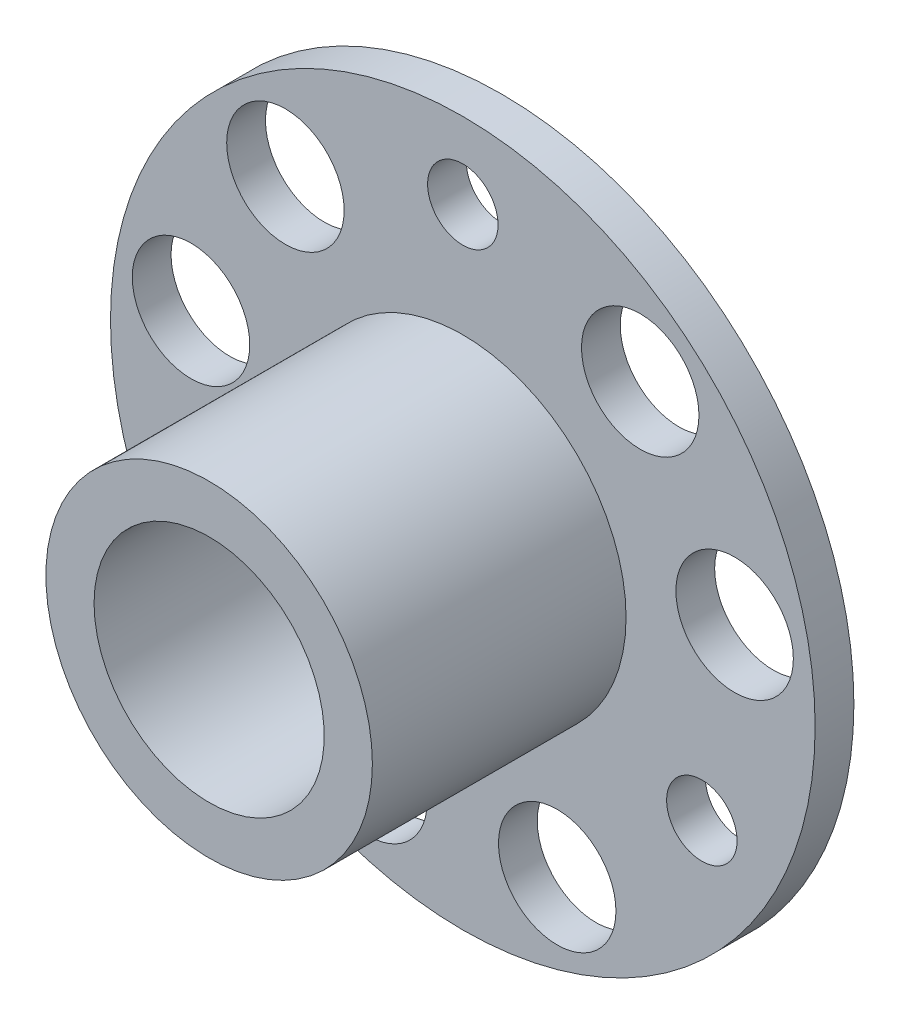
ISO-10303-21;
HEADER;
FILE_DESCRIPTION(('STEP AP214'),'2;1');
FILE_NAME('part.step','',(''),(''),'','','');
FILE_SCHEMA(('AUTOMOTIVE_DESIGN { 1 0 10303 214 1 1 1 1 }'));
ENDSEC;
DATA;
#1=APPLICATION_CONTEXT('core data for automotive mechanical design processes');
#2=APPLICATION_PROTOCOL_DEFINITION('international standard','automotive_design',2000,#1);
#3=PRODUCT_CONTEXT('',#1,'mechanical');
#4=PRODUCT('Part','Part','',(#3));
#5=PRODUCT_RELATED_PRODUCT_CATEGORY('part','',(#4));
#6=PRODUCT_DEFINITION_FORMATION('','',#4);
#7=PRODUCT_DEFINITION_CONTEXT('part definition',#1,'design');
#8=PRODUCT_DEFINITION('design','',#6,#7);
#9=PRODUCT_DEFINITION_SHAPE('','',#8);
#10=(LENGTH_UNIT() NAMED_UNIT(*) SI_UNIT(.MILLI.,.METRE.));
#11=(NAMED_UNIT(*) PLANE_ANGLE_UNIT() SI_UNIT($,.RADIAN.));
#12=(NAMED_UNIT(*) SI_UNIT($,.STERADIAN.) SOLID_ANGLE_UNIT());
#13=UNCERTAINTY_MEASURE_WITH_UNIT(LENGTH_MEASURE(1.E-05),#10,'distance_accuracy_value','');
#14=(GEOMETRIC_REPRESENTATION_CONTEXT(3) GLOBAL_UNCERTAINTY_ASSIGNED_CONTEXT((#13)) GLOBAL_UNIT_ASSIGNED_CONTEXT((#10,
#11,#12)) REPRESENTATION_CONTEXT('',''));
#15=CARTESIAN_POINT('',(0.,0.,0.));
#16=DIRECTION('',(0.,0.,1.));
#17=DIRECTION('',(1.,0.,0.));
#18=AXIS2_PLACEMENT_3D('',#15,#16,#17);
#19=CARTESIAN_POINT('',(0.,0.,1.65));
#20=DIRECTION('',(0.,0.,1.));
#21=DIRECTION('',(1.,0.,0.));
#22=AXIS2_PLACEMENT_3D('',#19,#20,#21);
#23=PLANE('',#22);
#24=CARTESIAN_POINT('',(0.,11.75,1.65));
#25=DIRECTION('',(0.,0.,1.));
#26=DIRECTION('',(1.,0.,0.));
#27=AXIS2_PLACEMENT_3D('',#24,#25,#26);
#28=CIRCLE('',#27,1.49999999999999);
#29=CARTESIAN_POINT('',(1.49999999999999,11.75,1.65));
#30=VERTEX_POINT('',#29);
#31=EDGE_CURVE('E104',#30,#30,#28,.T.);
#32=ORIENTED_EDGE('',*,*,#31,.F.);
#33=EDGE_LOOP('',(#32));
#34=FACE_BOUND('',#33,.T.);
#35=CARTESIAN_POINT('',(-10.1757984944672,-5.875,1.65));
#36=DIRECTION('',(0.,0.,1.));
#37=DIRECTION('',(1.,0.,0.));
#38=AXIS2_PLACEMENT_3D('',#35,#36,#37);
#39=CIRCLE('',#38,1.49999999999999);
#40=CARTESIAN_POINT('',(-8.67579849446717,-5.875,1.65));
#41=VERTEX_POINT('',#40);
#42=EDGE_CURVE('E98',#41,#41,#39,.T.);
#43=ORIENTED_EDGE('',*,*,#42,.F.);
#44=EDGE_LOOP('',(#43));
#45=FACE_BOUND('',#44,.T.);
#46=CARTESIAN_POINT('',(10.1757984944672,-5.87500000000001,1.65));
#47=DIRECTION('',(0.,0.,1.));
#48=DIRECTION('',(1.,0.,0.));
#49=AXIS2_PLACEMENT_3D('',#46,#47,#48);
#50=CIRCLE('',#49,1.49999999999999);
#51=CARTESIAN_POINT('',(11.6757984944671,-5.87500000000001,1.65));
#52=VERTEX_POINT('',#51);
#53=EDGE_CURVE('E92',#52,#52,#50,.T.);
#54=ORIENTED_EDGE('',*,*,#53,.F.);
#55=EDGE_LOOP('',(#54));
#56=FACE_BOUND('',#55,.T.);
#57=CARTESIAN_POINT('',(-7.55275441381684,9.00102220664799,1.65));
#58=DIRECTION('',(0.,0.,1.));
#59=DIRECTION('',(1.,0.,0.));
#60=AXIS2_PLACEMENT_3D('',#57,#58,#59);
#61=CIRCLE('',#60,2.49999999999999);
#62=CARTESIAN_POINT('',(-5.05275441381685,9.00102220664799,1.65));
#63=VERTEX_POINT('',#62);
#64=EDGE_CURVE('E86',#63,#63,#61,.T.);
#65=ORIENTED_EDGE('',*,*,#64,.F.);
#66=EDGE_LOOP('',(#65));
#67=FACE_BOUND('',#66,.T.);
#68=CARTESIAN_POINT('',(-11.5714910978934,2.04036608758643,1.65));
#69=DIRECTION('',(0.,0.,1.));
#70=DIRECTION('',(1.,0.,0.));
#71=AXIS2_PLACEMENT_3D('',#68,#69,#70);
#72=CIRCLE('',#71,2.49999999999999);
#73=CARTESIAN_POINT('',(-9.07149109789346,2.04036608758643,1.65));
#74=VERTEX_POINT('',#73);
#75=EDGE_CURVE('E80',#74,#74,#72,.T.);
#76=ORIENTED_EDGE('',*,*,#75,.F.);
#77=EDGE_LOOP('',(#76));
#78=FACE_BOUND('',#77,.T.);
#79=CARTESIAN_POINT('',(-4.01873668407661,-11.0413882942344,1.65));
#80=DIRECTION('',(0.,0.,1.));
#81=DIRECTION('',(1.,0.,0.));
#82=AXIS2_PLACEMENT_3D('',#79,#80,#81);
#83=CIRCLE('',#82,2.49999999999999);
#84=CARTESIAN_POINT('',(-1.51873668407662,-11.0413882942344,1.65));
#85=VERTEX_POINT('',#84);
#86=EDGE_CURVE('E74',#85,#85,#83,.T.);
#87=ORIENTED_EDGE('',*,*,#86,.F.);
#88=EDGE_LOOP('',(#87));
#89=FACE_BOUND('',#88,.T.);
#90=CARTESIAN_POINT('',(4.01873668407661,-11.0413882942344,1.65));
#91=DIRECTION('',(0.,0.,1.));
#92=DIRECTION('',(1.,0.,0.));
#93=AXIS2_PLACEMENT_3D('',#90,#91,#92);
#94=CIRCLE('',#93,2.49999999999999);
#95=CARTESIAN_POINT('',(6.51873668407659,-11.0413882942344,1.65));
#96=VERTEX_POINT('',#95);
#97=EDGE_CURVE('E68',#96,#96,#94,.T.);
#98=ORIENTED_EDGE('',*,*,#97,.F.);
#99=EDGE_LOOP('',(#98));
#100=FACE_BOUND('',#99,.T.);
#101=CARTESIAN_POINT('',(11.5714910978934,2.04036608758643,1.65));
#102=DIRECTION('',(0.,0.,1.));
#103=DIRECTION('',(1.,0.,0.));
#104=AXIS2_PLACEMENT_3D('',#101,#102,#103);
#105=CIRCLE('',#104,2.49999999999999);
#106=CARTESIAN_POINT('',(14.0714910978934,2.04036608758643,1.65));
#107=VERTEX_POINT('',#106);
#108=EDGE_CURVE('E62',#107,#107,#105,.T.);
#109=ORIENTED_EDGE('',*,*,#108,.F.);
#110=EDGE_LOOP('',(#109));
#111=FACE_BOUND('',#110,.T.);
#112=CARTESIAN_POINT('',(7.55275441381684,9.00102220664799,1.65));
#113=DIRECTION('',(0.,0.,1.));
#114=DIRECTION('',(1.,0.,0.));
#115=AXIS2_PLACEMENT_3D('',#112,#113,#114);
#116=CIRCLE('',#115,2.49999999999999);
#117=CARTESIAN_POINT('',(10.0527544138168,9.00102220664799,1.65));
#118=VERTEX_POINT('',#117);
#119=EDGE_CURVE('E54',#118,#118,#116,.T.);
#120=ORIENTED_EDGE('',*,*,#119,.F.);
#121=EDGE_LOOP('',(#120));
#122=FACE_BOUND('',#121,.T.);
#123=CARTESIAN_POINT('',(0.,0.,1.65));
#124=DIRECTION('',(0.,0.,1.));
#125=DIRECTION('',(1.,0.,0.));
#126=AXIS2_PLACEMENT_3D('',#123,#124,#125);
#127=CIRCLE('',#126,15.);
#128=CARTESIAN_POINT('',(15.,0.,1.65));
#129=VERTEX_POINT('',#128);
#130=EDGE_CURVE('E45',#129,#129,#127,.T.);
#131=ORIENTED_EDGE('',*,*,#130,.T.);
#132=EDGE_LOOP('',(#131));
#133=FACE_BOUND('',#132,.T.);
#134=CARTESIAN_POINT('',(0.,0.,1.65));
#135=DIRECTION('',(0.,0.,1.));
#136=DIRECTION('',(1.,0.,0.));
#137=AXIS2_PLACEMENT_3D('',#134,#135,#136);
#138=CIRCLE('',#137,6.95);
#139=CARTESIAN_POINT('',(6.95,0.,1.65));
#140=VERTEX_POINT('',#139);
#141=EDGE_CURVE('E51',#140,#140,#138,.T.);
#142=ORIENTED_EDGE('',*,*,#141,.F.);
#143=EDGE_LOOP('',(#142));
#144=FACE_BOUND('',#143,.T.);
#145=ADVANCED_FACE('F30',(#34,#45,#56,#67,#78,#89,#100,#111,#122,#133,#144),#23,.T.);
#146=CARTESIAN_POINT('',(0.,0.,0.));
#147=DIRECTION('',(0.,0.,1.));
#148=DIRECTION('',(1.,0.,0.));
#149=AXIS2_PLACEMENT_3D('',#146,#147,#148);
#150=CYLINDRICAL_SURFACE('',#149,15.);
#151=CARTESIAN_POINT('',(0.,0.,0.));
#152=DIRECTION('',(0.,0.,1.));
#153=DIRECTION('',(1.,0.,0.));
#154=AXIS2_PLACEMENT_3D('',#151,#152,#153);
#155=CIRCLE('',#154,15.);
#156=CARTESIAN_POINT('',(15.,0.,0.));
#157=VERTEX_POINT('',#156);
#158=EDGE_CURVE('E41',#157,#157,#155,.T.);
#159=ORIENTED_EDGE('',*,*,#158,.T.);
#160=EDGE_LOOP('',(#159));
#161=FACE_BOUND('',#160,.T.);
#162=ORIENTED_EDGE('',*,*,#130,.F.);
#163=EDGE_LOOP('',(#162));
#164=FACE_BOUND('',#163,.T.);
#165=ADVANCED_FACE('F130',(#161,#164),#150,.T.);
#166=CARTESIAN_POINT('',(15.,0.,0.));
#167=DIRECTION('',(0.,0.,-1.));
#168=DIRECTION('',(-1.,0.,0.));
#169=AXIS2_PLACEMENT_3D('',#166,#167,#168);
#170=PLANE('',#169);
#171=CARTESIAN_POINT('',(0.,0.,0.));
#172=DIRECTION('',(0.,0.,-1.));
#173=DIRECTION('',(-1.,0.,0.));
#174=AXIS2_PLACEMENT_3D('',#171,#172,#173);
#175=CIRCLE('',#174,5.39999999999999);
#176=CARTESIAN_POINT('',(-5.39999999999999,0.,0.));
#177=VERTEX_POINT('',#176);
#178=EDGE_CURVE('E10',#177,#177,#175,.F.);
#179=ORIENTED_EDGE('',*,*,#178,.T.);
#180=EDGE_LOOP('',(#179));
#181=FACE_BOUND('',#180,.T.);
#182=CARTESIAN_POINT('',(0.,11.75,0.));
#183=DIRECTION('',(0.,0.,-1.));
#184=DIRECTION('',(-1.,0.,0.));
#185=AXIS2_PLACEMENT_3D('',#182,#183,#184);
#186=CIRCLE('',#185,1.49999999999999);
#187=CARTESIAN_POINT('',(-1.49999999999999,11.75,0.));
#188=VERTEX_POINT('',#187);
#189=EDGE_CURVE('E107',#188,#188,#186,.T.);
#190=ORIENTED_EDGE('',*,*,#189,.F.);
#191=EDGE_LOOP('',(#190));
#192=FACE_BOUND('',#191,.T.);
#193=CARTESIAN_POINT('',(-10.1757984944672,-5.875,0.));
#194=DIRECTION('',(0.,0.,-1.));
#195=DIRECTION('',(-1.,0.,0.));
#196=AXIS2_PLACEMENT_3D('',#193,#194,#195);
#197=CIRCLE('',#196,1.49999999999999);
#198=CARTESIAN_POINT('',(-11.6757984944671,-5.875,0.));
#199=VERTEX_POINT('',#198);
#200=EDGE_CURVE('E101',#199,#199,#197,.T.);
#201=ORIENTED_EDGE('',*,*,#200,.F.);
#202=EDGE_LOOP('',(#201));
#203=FACE_BOUND('',#202,.T.);
#204=CARTESIAN_POINT('',(10.1757984944672,-5.87500000000001,0.));
#205=DIRECTION('',(0.,0.,-1.));
#206=DIRECTION('',(-1.,0.,0.));
#207=AXIS2_PLACEMENT_3D('',#204,#205,#206);
#208=CIRCLE('',#207,1.49999999999999);
#209=CARTESIAN_POINT('',(8.67579849446716,-5.87500000000001,0.));
#210=VERTEX_POINT('',#209);
#211=EDGE_CURVE('E95',#210,#210,#208,.T.);
#212=ORIENTED_EDGE('',*,*,#211,.F.);
#213=EDGE_LOOP('',(#212));
#214=FACE_BOUND('',#213,.T.);
#215=CARTESIAN_POINT('',(-7.55275441381684,9.00102220664799,0.));
#216=DIRECTION('',(0.,0.,-1.));
#217=DIRECTION('',(-1.,0.,0.));
#218=AXIS2_PLACEMENT_3D('',#215,#216,#217);
#219=CIRCLE('',#218,2.49999999999999);
#220=CARTESIAN_POINT('',(-10.0527544138168,9.00102220664799,0.));
#221=VERTEX_POINT('',#220);
#222=EDGE_CURVE('E89',#221,#221,#219,.T.);
#223=ORIENTED_EDGE('',*,*,#222,.F.);
#224=EDGE_LOOP('',(#223));
#225=FACE_BOUND('',#224,.T.);
#226=CARTESIAN_POINT('',(-11.5714910978934,2.04036608758643,0.));
#227=DIRECTION('',(0.,0.,-1.));
#228=DIRECTION('',(-1.,0.,0.));
#229=AXIS2_PLACEMENT_3D('',#226,#227,#228);
#230=CIRCLE('',#229,2.49999999999999);
#231=CARTESIAN_POINT('',(-14.0714910978934,2.04036608758643,0.));
#232=VERTEX_POINT('',#231);
#233=EDGE_CURVE('E83',#232,#232,#230,.T.);
#234=ORIENTED_EDGE('',*,*,#233,.F.);
#235=EDGE_LOOP('',(#234));
#236=FACE_BOUND('',#235,.T.);
#237=CARTESIAN_POINT('',(-4.01873668407661,-11.0413882942344,0.));
#238=DIRECTION('',(0.,0.,-1.));
#239=DIRECTION('',(-1.,0.,0.));
#240=AXIS2_PLACEMENT_3D('',#237,#238,#239);
#241=CIRCLE('',#240,2.49999999999999);
#242=CARTESIAN_POINT('',(-6.5187366840766,-11.0413882942344,0.));
#243=VERTEX_POINT('',#242);
#244=EDGE_CURVE('E77',#243,#243,#241,.T.);
#245=ORIENTED_EDGE('',*,*,#244,.F.);
#246=EDGE_LOOP('',(#245));
#247=FACE_BOUND('',#246,.T.);
#248=CARTESIAN_POINT('',(4.01873668407661,-11.0413882942344,0.));
#249=DIRECTION('',(0.,0.,-1.));
#250=DIRECTION('',(-1.,0.,0.));
#251=AXIS2_PLACEMENT_3D('',#248,#249,#250);
#252=CIRCLE('',#251,2.49999999999999);
#253=CARTESIAN_POINT('',(1.51873668407662,-11.0413882942344,0.));
#254=VERTEX_POINT('',#253);
#255=EDGE_CURVE('E71',#254,#254,#252,.T.);
#256=ORIENTED_EDGE('',*,*,#255,.F.);
#257=EDGE_LOOP('',(#256));
#258=FACE_BOUND('',#257,.T.);
#259=CARTESIAN_POINT('',(11.5714910978934,2.04036608758643,0.));
#260=DIRECTION('',(0.,0.,-1.));
#261=DIRECTION('',(-1.,0.,0.));
#262=AXIS2_PLACEMENT_3D('',#259,#260,#261);
#263=CIRCLE('',#262,2.49999999999999);
#264=CARTESIAN_POINT('',(9.07149109789346,2.04036608758643,0.));
#265=VERTEX_POINT('',#264);
#266=EDGE_CURVE('E65',#265,#265,#263,.T.);
#267=ORIENTED_EDGE('',*,*,#266,.F.);
#268=EDGE_LOOP('',(#267));
#269=FACE_BOUND('',#268,.T.);
#270=CARTESIAN_POINT('',(7.55275441381684,9.00102220664799,0.));
#271=DIRECTION('',(0.,0.,-1.));
#272=DIRECTION('',(-1.,0.,0.));
#273=AXIS2_PLACEMENT_3D('',#270,#271,#272);
#274=CIRCLE('',#273,2.49999999999999);
#275=CARTESIAN_POINT('',(5.05275441381685,9.00102220664799,0.));
#276=VERTEX_POINT('',#275);
#277=EDGE_CURVE('E59',#276,#276,#274,.T.);
#278=ORIENTED_EDGE('',*,*,#277,.F.);
#279=EDGE_LOOP('',(#278));
#280=FACE_BOUND('',#279,.T.);
#281=ORIENTED_EDGE('',*,*,#158,.F.);
#282=EDGE_LOOP('',(#281));
#283=FACE_BOUND('',#282,.T.);
#284=ADVANCED_FACE('F136',(#181,#192,#203,#214,#225,#236,#247,#258,#269,#280,#283),#170,.T.);
#285=CARTESIAN_POINT('',(0.,0.,12.45));
#286=DIRECTION('',(0.,0.,-1.));
#287=DIRECTION('',(-1.,0.,0.));
#288=AXIS2_PLACEMENT_3D('',#285,#286,#287);
#289=CYLINDRICAL_SURFACE('',#288,6.95);
#290=CARTESIAN_POINT('',(0.,0.,12.45));
#291=DIRECTION('',(0.,0.,1.));
#292=DIRECTION('',(1.,0.,0.));
#293=AXIS2_PLACEMENT_3D('',#290,#291,#292);
#294=CIRCLE('',#293,6.95);
#295=CARTESIAN_POINT('',(6.95,0.,12.45));
#296=VERTEX_POINT('',#295);
#297=EDGE_CURVE('E50',#296,#296,#294,.T.);
#298=ORIENTED_EDGE('',*,*,#297,.F.);
#299=EDGE_LOOP('',(#298));
#300=FACE_BOUND('',#299,.T.);
#301=ORIENTED_EDGE('',*,*,#141,.T.);
#302=EDGE_LOOP('',(#301));
#303=FACE_BOUND('',#302,.T.);
#304=ADVANCED_FACE('F142',(#300,#303),#289,.T.);
#305=CARTESIAN_POINT('',(0.,0.,12.45));
#306=DIRECTION('',(0.,0.,1.));
#307=DIRECTION('',(1.,0.,0.));
#308=AXIS2_PLACEMENT_3D('',#305,#306,#307);
#309=PLANE('',#308);
#310=CARTESIAN_POINT('',(0.,0.,12.45));
#311=DIRECTION('',(0.,0.,-1.));
#312=DIRECTION('',(-1.,0.,0.));
#313=AXIS2_PLACEMENT_3D('',#310,#311,#312);
#314=CIRCLE('',#313,4.89999999999999);
#315=CARTESIAN_POINT('',(-4.89999999999999,0.,12.45));
#316=VERTEX_POINT('',#315);
#317=EDGE_CURVE('E110',#316,#316,#314,.T.);
#318=ORIENTED_EDGE('',*,*,#317,.T.);
#319=EDGE_LOOP('',(#318));
#320=FACE_BOUND('',#319,.T.);
#321=ORIENTED_EDGE('',*,*,#297,.T.);
#322=EDGE_LOOP('',(#321));
#323=FACE_BOUND('',#322,.T.);
#324=ADVANCED_FACE('F114',(#320,#323),#309,.T.);
#325=CARTESIAN_POINT('',(7.55275441381684,9.00102220664799,0.));
#326=DIRECTION('',(0.,0.,-1.));
#327=DIRECTION('',(-1.,0.,0.));
#328=AXIS2_PLACEMENT_3D('',#325,#326,#327);
#329=CYLINDRICAL_SURFACE('',#328,2.49999999999999);
#330=ORIENTED_EDGE('',*,*,#119,.T.);
#331=EDGE_LOOP('',(#330));
#332=FACE_BOUND('',#331,.T.);
#333=ORIENTED_EDGE('',*,*,#277,.T.);
#334=EDGE_LOOP('',(#333));
#335=FACE_BOUND('',#334,.T.);
#336=ADVANCED_FACE('F176',(#332,#335),#329,.F.);
#337=CARTESIAN_POINT('',(11.5714910978934,2.04036608758643,0.));
#338=DIRECTION('',(0.,0.,-1.));
#339=DIRECTION('',(-1.,0.,0.));
#340=AXIS2_PLACEMENT_3D('',#337,#338,#339);
#341=CYLINDRICAL_SURFACE('',#340,2.49999999999999);
#342=ORIENTED_EDGE('',*,*,#108,.T.);
#343=EDGE_LOOP('',(#342));
#344=FACE_BOUND('',#343,.T.);
#345=ORIENTED_EDGE('',*,*,#266,.T.);
#346=EDGE_LOOP('',(#345));
#347=FACE_BOUND('',#346,.T.);
#348=ADVANCED_FACE('F178',(#344,#347),#341,.F.);
#349=CARTESIAN_POINT('',(4.01873668407661,-11.0413882942344,0.));
#350=DIRECTION('',(0.,0.,-1.));
#351=DIRECTION('',(-1.,0.,0.));
#352=AXIS2_PLACEMENT_3D('',#349,#350,#351);
#353=CYLINDRICAL_SURFACE('',#352,2.49999999999999);
#354=ORIENTED_EDGE('',*,*,#97,.T.);
#355=EDGE_LOOP('',(#354));
#356=FACE_BOUND('',#355,.T.);
#357=ORIENTED_EDGE('',*,*,#255,.T.);
#358=EDGE_LOOP('',(#357));
#359=FACE_BOUND('',#358,.T.);
#360=ADVANCED_FACE('F185',(#356,#359),#353,.F.);
#361=CARTESIAN_POINT('',(-4.01873668407661,-11.0413882942344,0.));
#362=DIRECTION('',(0.,0.,-1.));
#363=DIRECTION('',(-1.,0.,0.));
#364=AXIS2_PLACEMENT_3D('',#361,#362,#363);
#365=CYLINDRICAL_SURFACE('',#364,2.49999999999999);
#366=ORIENTED_EDGE('',*,*,#86,.T.);
#367=EDGE_LOOP('',(#366));
#368=FACE_BOUND('',#367,.T.);
#369=ORIENTED_EDGE('',*,*,#244,.T.);
#370=EDGE_LOOP('',(#369));
#371=FACE_BOUND('',#370,.T.);
#372=ADVANCED_FACE('F191',(#368,#371),#365,.F.);
#373=CARTESIAN_POINT('',(-11.5714910978934,2.04036608758643,0.));
#374=DIRECTION('',(0.,0.,-1.));
#375=DIRECTION('',(-1.,0.,0.));
#376=AXIS2_PLACEMENT_3D('',#373,#374,#375);
#377=CYLINDRICAL_SURFACE('',#376,2.49999999999999);
#378=ORIENTED_EDGE('',*,*,#75,.T.);
#379=EDGE_LOOP('',(#378));
#380=FACE_BOUND('',#379,.T.);
#381=ORIENTED_EDGE('',*,*,#233,.T.);
#382=EDGE_LOOP('',(#381));
#383=FACE_BOUND('',#382,.T.);
#384=ADVANCED_FACE('F195',(#380,#383),#377,.F.);
#385=CARTESIAN_POINT('',(-7.55275441381684,9.00102220664799,0.));
#386=DIRECTION('',(0.,0.,-1.));
#387=DIRECTION('',(-1.,0.,0.));
#388=AXIS2_PLACEMENT_3D('',#385,#386,#387);
#389=CYLINDRICAL_SURFACE('',#388,2.49999999999999);
#390=ORIENTED_EDGE('',*,*,#64,.T.);
#391=EDGE_LOOP('',(#390));
#392=FACE_BOUND('',#391,.T.);
#393=ORIENTED_EDGE('',*,*,#222,.T.);
#394=EDGE_LOOP('',(#393));
#395=FACE_BOUND('',#394,.T.);
#396=ADVANCED_FACE('F199',(#392,#395),#389,.F.);
#397=CARTESIAN_POINT('',(10.1757984944672,-5.87500000000001,0.));
#398=DIRECTION('',(0.,0.,-1.));
#399=DIRECTION('',(-1.,0.,0.));
#400=AXIS2_PLACEMENT_3D('',#397,#398,#399);
#401=CYLINDRICAL_SURFACE('',#400,1.49999999999999);
#402=ORIENTED_EDGE('',*,*,#53,.T.);
#403=EDGE_LOOP('',(#402));
#404=FACE_BOUND('',#403,.T.);
#405=ORIENTED_EDGE('',*,*,#211,.T.);
#406=EDGE_LOOP('',(#405));
#407=FACE_BOUND('',#406,.T.);
#408=ADVANCED_FACE('F203',(#404,#407),#401,.F.);
#409=CARTESIAN_POINT('',(-10.1757984944672,-5.875,0.));
#410=DIRECTION('',(0.,0.,-1.));
#411=DIRECTION('',(-1.,0.,0.));
#412=AXIS2_PLACEMENT_3D('',#409,#410,#411);
#413=CYLINDRICAL_SURFACE('',#412,1.49999999999999);
#414=ORIENTED_EDGE('',*,*,#42,.T.);
#415=EDGE_LOOP('',(#414));
#416=FACE_BOUND('',#415,.T.);
#417=ORIENTED_EDGE('',*,*,#200,.T.);
#418=EDGE_LOOP('',(#417));
#419=FACE_BOUND('',#418,.T.);
#420=ADVANCED_FACE('F126',(#416,#419),#413,.F.);
#421=CARTESIAN_POINT('',(0.,11.75,0.));
#422=DIRECTION('',(0.,0.,-1.));
#423=DIRECTION('',(-1.,0.,0.));
#424=AXIS2_PLACEMENT_3D('',#421,#422,#423);
#425=CYLINDRICAL_SURFACE('',#424,1.49999999999999);
#426=ORIENTED_EDGE('',*,*,#31,.T.);
#427=EDGE_LOOP('',(#426));
#428=FACE_BOUND('',#427,.T.);
#429=ORIENTED_EDGE('',*,*,#189,.T.);
#430=EDGE_LOOP('',(#429));
#431=FACE_BOUND('',#430,.T.);
#432=ADVANCED_FACE('F119',(#428,#431),#425,.F.);
#433=CARTESIAN_POINT('',(0.,0.,0.));
#434=DIRECTION('',(0.,0.,-1.));
#435=DIRECTION('',(-1.,0.,0.));
#436=AXIS2_PLACEMENT_3D('',#433,#434,#435);
#437=CYLINDRICAL_SURFACE('',#436,4.89999999999999);
#438=CARTESIAN_POINT('',(0.,0.,0.5));
#439=DIRECTION('',(0.,0.,-1.));
#440=DIRECTION('',(-1.,0.,0.));
#441=AXIS2_PLACEMENT_3D('',#438,#439,#440);
#442=CIRCLE('',#441,4.89999999999999);
#443=CARTESIAN_POINT('',(-4.89999999999999,0.,0.5));
#444=VERTEX_POINT('',#443);
#445=EDGE_CURVE('E37',#444,#444,#442,.T.);
#446=ORIENTED_EDGE('',*,*,#445,.T.);
#447=EDGE_LOOP('',(#446));
#448=FACE_BOUND('',#447,.T.);
#449=ORIENTED_EDGE('',*,*,#317,.F.);
#450=EDGE_LOOP('',(#449));
#451=FACE_BOUND('',#450,.T.);
#452=ADVANCED_FACE('F117',(#448,#451),#437,.F.);
#453=CARTESIAN_POINT('',(0.,0.,0.5));
#454=DIRECTION('',(0.,0.,-1.));
#455=DIRECTION('',(-1.,0.,0.));
#456=AXIS2_PLACEMENT_3D('',#453,#454,#455);
#457=TOROIDAL_SURFACE('',#456,5.39999999999999,0.5);
#458=ORIENTED_EDGE('',*,*,#178,.F.);
#459=EDGE_LOOP('',(#458));
#460=FACE_BOUND('',#459,.T.);
#461=ORIENTED_EDGE('',*,*,#445,.F.);
#462=EDGE_LOOP('',(#461));
#463=FACE_BOUND('',#462,.T.);
#464=ADVANCED_FACE('F32',(#460,#463),#457,.T.);
#465=CLOSED_SHELL('',(#145,#165,#284,#304,#324,#336,#348,#360,#372,#384,#396,#408,#420,#432,
#452,#464));
#466=MANIFOLD_SOLID_BREP('B2',#465);
#467=ADVANCED_BREP_SHAPE_REPRESENTATION('',(#18,#466),#14);
#468=SHAPE_DEFINITION_REPRESENTATION(#9,#467);
ENDSEC;
END-ISO-10303-21;
